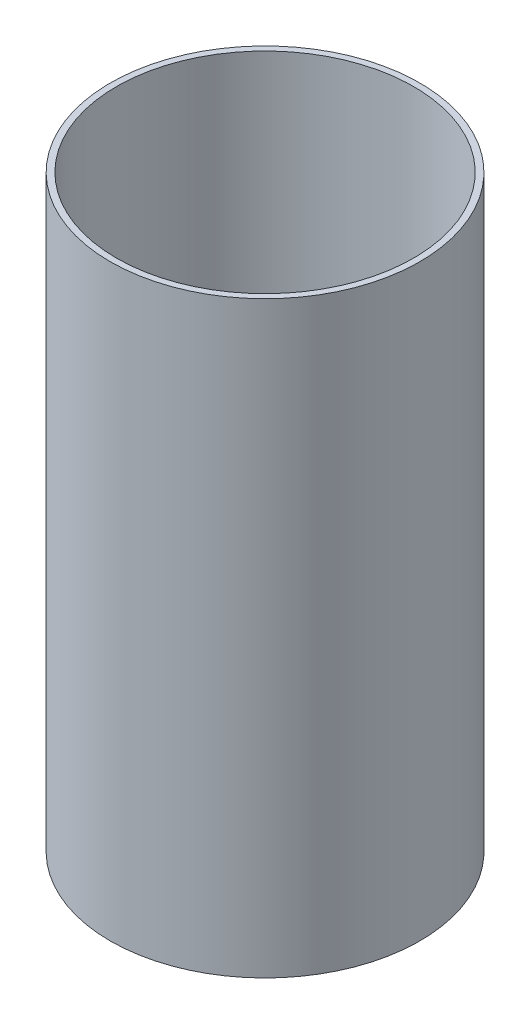
ISO-10303-21;
HEADER;
FILE_DESCRIPTION(('STEP AP214'),'2;1');
FILE_NAME('part.step','',(''),(''),'','','');
FILE_SCHEMA(('AUTOMOTIVE_DESIGN { 1 0 10303 214 1 1 1 1 }'));
ENDSEC;
DATA;
#1=APPLICATION_CONTEXT('core data for automotive mechanical design processes');
#2=APPLICATION_PROTOCOL_DEFINITION('international standard','automotive_design',2000,#1);
#3=PRODUCT_CONTEXT('',#1,'mechanical');
#4=PRODUCT('Part','Part','',(#3));
#5=PRODUCT_RELATED_PRODUCT_CATEGORY('part','',(#4));
#6=PRODUCT_DEFINITION_FORMATION('','',#4);
#7=PRODUCT_DEFINITION_CONTEXT('part definition',#1,'design');
#8=PRODUCT_DEFINITION('design','',#6,#7);
#9=PRODUCT_DEFINITION_SHAPE('','',#8);
#10=(LENGTH_UNIT() NAMED_UNIT(*) SI_UNIT(.MILLI.,.METRE.));
#11=(NAMED_UNIT(*) PLANE_ANGLE_UNIT() SI_UNIT($,.RADIAN.));
#12=(NAMED_UNIT(*) SI_UNIT($,.STERADIAN.) SOLID_ANGLE_UNIT());
#13=UNCERTAINTY_MEASURE_WITH_UNIT(LENGTH_MEASURE(1.E-05),#10,'distance_accuracy_value','');
#14=(GEOMETRIC_REPRESENTATION_CONTEXT(3) GLOBAL_UNCERTAINTY_ASSIGNED_CONTEXT((#13)) GLOBAL_UNIT_ASSIGNED_CONTEXT((#10,
#11,#12)) REPRESENTATION_CONTEXT('',''));
#15=CARTESIAN_POINT('',(0.,0.,0.));
#16=DIRECTION('',(0.,0.,1.));
#17=DIRECTION('',(1.,0.,0.));
#18=AXIS2_PLACEMENT_3D('',#15,#16,#17);
#19=CARTESIAN_POINT('',(0.,72.39,0.));
#20=DIRECTION('',(0.,1.,0.));
#21=DIRECTION('',(0.,0.,1.));
#22=AXIS2_PLACEMENT_3D('',#19,#20,#21);
#23=PLANE('',#22);
#24=CARTESIAN_POINT('',(0.,72.39,0.));
#25=DIRECTION('',(0.,1.,0.));
#26=DIRECTION('',(0.,0.,1.));
#27=AXIS2_PLACEMENT_3D('',#24,#25,#26);
#28=CIRCLE('',#27,38.1);
#29=CARTESIAN_POINT('',(0.,72.39,38.1));
#30=VERTEX_POINT('',#29);
#31=EDGE_CURVE('E10',#30,#30,#28,.T.);
#32=ORIENTED_EDGE('',*,*,#31,.T.);
#33=EDGE_LOOP('',(#32));
#34=FACE_BOUND('',#33,.T.);
#35=CARTESIAN_POINT('',(0.,72.39,0.));
#36=DIRECTION('',(0.,1.,0.));
#37=DIRECTION('',(0.,0.,1.));
#38=AXIS2_PLACEMENT_3D('',#35,#36,#37);
#39=CIRCLE('',#38,36.576);
#40=CARTESIAN_POINT('',(0.,72.39,36.576));
#41=VERTEX_POINT('',#40);
#42=EDGE_CURVE('E45',#41,#41,#39,.T.);
#43=ORIENTED_EDGE('',*,*,#42,.F.);
#44=EDGE_LOOP('',(#43));
#45=FACE_BOUND('',#44,.T.);
#46=ADVANCED_FACE('F34',(#34,#45),#23,.T.);
#47=CARTESIAN_POINT('',(0.,-72.39,0.));
#48=DIRECTION('',(0.,1.,0.));
#49=DIRECTION('',(0.,0.,1.));
#50=AXIS2_PLACEMENT_3D('',#47,#48,#49);
#51=PLANE('',#50);
#52=CARTESIAN_POINT('',(0.,-72.39,0.));
#53=DIRECTION('',(0.,1.,0.));
#54=DIRECTION('',(0.,0.,1.));
#55=AXIS2_PLACEMENT_3D('',#52,#53,#54);
#56=CIRCLE('',#55,38.1);
#57=CARTESIAN_POINT('',(0.,-72.39,38.1));
#58=VERTEX_POINT('',#57);
#59=EDGE_CURVE('E38',#58,#58,#56,.T.);
#60=ORIENTED_EDGE('',*,*,#59,.F.);
#61=EDGE_LOOP('',(#60));
#62=FACE_BOUND('',#61,.T.);
#63=CARTESIAN_POINT('',(0.,-72.39,0.));
#64=DIRECTION('',(0.,1.,0.));
#65=DIRECTION('',(0.,0.,1.));
#66=AXIS2_PLACEMENT_3D('',#63,#64,#65);
#67=CIRCLE('',#66,36.576);
#68=CARTESIAN_POINT('',(0.,-72.39,36.576));
#69=VERTEX_POINT('',#68);
#70=EDGE_CURVE('E47',#69,#69,#67,.T.);
#71=ORIENTED_EDGE('',*,*,#70,.T.);
#72=EDGE_LOOP('',(#71));
#73=FACE_BOUND('',#72,.T.);
#74=ADVANCED_FACE('F57',(#62,#73),#51,.F.);
#75=CARTESIAN_POINT('',(0.,72.39,0.));
#76=DIRECTION('',(0.,-1.,0.));
#77=DIRECTION('',(0.,0.,-1.));
#78=AXIS2_PLACEMENT_3D('',#75,#76,#77);
#79=CYLINDRICAL_SURFACE('',#78,38.1);
#80=ORIENTED_EDGE('',*,*,#31,.F.);
#81=EDGE_LOOP('',(#80));
#82=FACE_BOUND('',#81,.T.);
#83=ORIENTED_EDGE('',*,*,#59,.T.);
#84=EDGE_LOOP('',(#83));
#85=FACE_BOUND('',#84,.T.);
#86=ADVANCED_FACE('F36',(#82,#85),#79,.T.);
#87=CARTESIAN_POINT('',(0.,72.39,0.));
#88=DIRECTION('',(0.,-1.,0.));
#89=DIRECTION('',(0.,0.,-1.));
#90=AXIS2_PLACEMENT_3D('',#87,#88,#89);
#91=CYLINDRICAL_SURFACE('',#90,36.576);
#92=ORIENTED_EDGE('',*,*,#42,.T.);
#93=EDGE_LOOP('',(#92));
#94=FACE_BOUND('',#93,.T.);
#95=ORIENTED_EDGE('',*,*,#70,.F.);
#96=EDGE_LOOP('',(#95));
#97=FACE_BOUND('',#96,.T.);
#98=ADVANCED_FACE('F53',(#94,#97),#91,.F.);
#99=CLOSED_SHELL('',(#46,#74,#86,#98));
#100=MANIFOLD_SOLID_BREP('B2',#99);
#101=ADVANCED_BREP_SHAPE_REPRESENTATION('',(#18,#100),#14);
#102=SHAPE_DEFINITION_REPRESENTATION(#9,#101);
ENDSEC;
END-ISO-10303-21;
